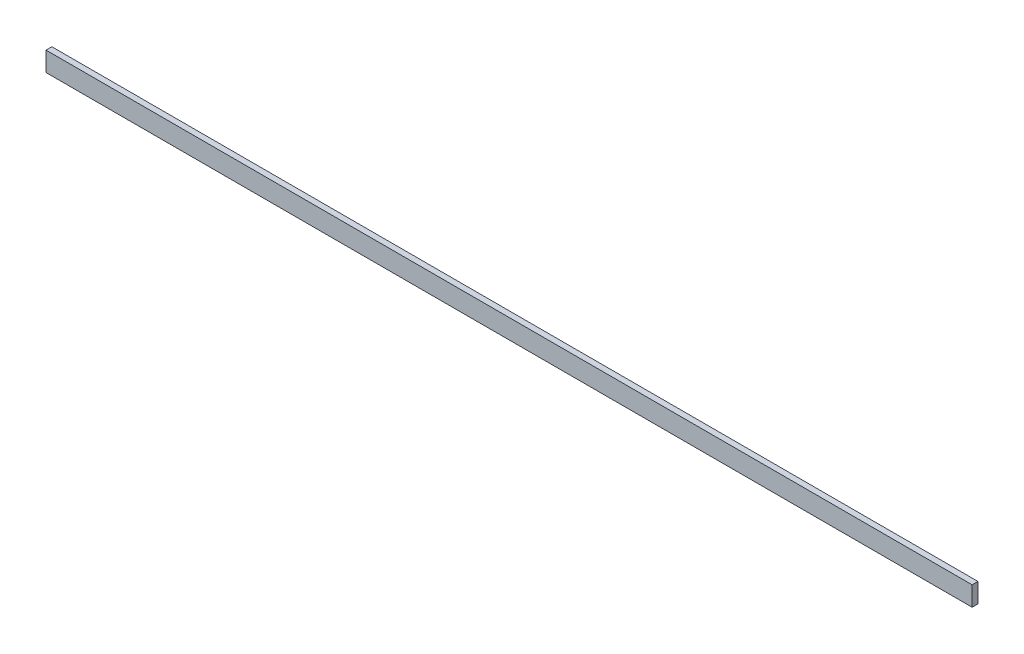
ISO-10303-21;
HEADER;
FILE_DESCRIPTION(('STEP AP214'),'2;1');
FILE_NAME('part.step','',(''),(''),'','','');
FILE_SCHEMA(('AUTOMOTIVE_DESIGN { 1 0 10303 214 1 1 1 1 }'));
ENDSEC;
DATA;
#1=APPLICATION_CONTEXT('core data for automotive mechanical design processes');
#2=APPLICATION_PROTOCOL_DEFINITION('international standard','automotive_design',2000,#1);
#3=PRODUCT_CONTEXT('',#1,'mechanical');
#4=PRODUCT('Part','Part','',(#3));
#5=PRODUCT_RELATED_PRODUCT_CATEGORY('part','',(#4));
#6=PRODUCT_DEFINITION_FORMATION('','',#4);
#7=PRODUCT_DEFINITION_CONTEXT('part definition',#1,'design');
#8=PRODUCT_DEFINITION('design','',#6,#7);
#9=PRODUCT_DEFINITION_SHAPE('','',#8);
#10=(LENGTH_UNIT() NAMED_UNIT(*) SI_UNIT(.MILLI.,.METRE.));
#11=(NAMED_UNIT(*) PLANE_ANGLE_UNIT() SI_UNIT($,.RADIAN.));
#12=(NAMED_UNIT(*) SI_UNIT($,.STERADIAN.) SOLID_ANGLE_UNIT());
#13=UNCERTAINTY_MEASURE_WITH_UNIT(LENGTH_MEASURE(1.E-05),#10,'distance_accuracy_value','');
#14=(GEOMETRIC_REPRESENTATION_CONTEXT(3) GLOBAL_UNCERTAINTY_ASSIGNED_CONTEXT((#13)) GLOBAL_UNIT_ASSIGNED_CONTEXT((#10,
#11,#12)) REPRESENTATION_CONTEXT('',''));
#15=CARTESIAN_POINT('',(0.,0.,0.));
#16=DIRECTION('',(0.,0.,1.));
#17=DIRECTION('',(1.,0.,0.));
#18=AXIS2_PLACEMENT_3D('',#15,#16,#17);
#19=CARTESIAN_POINT('',(0.,0.,-15.));
#20=DIRECTION('',(-1.,0.,0.));
#21=DIRECTION('',(0.,0.,1.));
#22=AXIS2_PLACEMENT_3D('',#19,#20,#21);
#23=PLANE('',#22);
#24=DIRECTION('',(0.,-1.,0.));
#25=VECTOR('',#24,1.);
#26=CARTESIAN_POINT('',(0.,0.,0.));
#27=LINE('',#26,#25);
#28=CARTESIAN_POINT('',(0.,0.,0.));
#29=VERTEX_POINT('',#28);
#30=CARTESIAN_POINT('',(0.,-50.,0.));
#31=VERTEX_POINT('',#30);
#32=EDGE_CURVE('E102',#29,#31,#27,.T.);
#33=ORIENTED_EDGE('',*,*,#32,.F.);
#34=DIRECTION('',(0.,0.,1.));
#35=VECTOR('',#34,1.);
#36=CARTESIAN_POINT('',(0.,0.,-15.));
#37=LINE('',#36,#35);
#38=CARTESIAN_POINT('',(0.,0.,-15.));
#39=VERTEX_POINT('',#38);
#40=EDGE_CURVE('E11',#39,#29,#37,.T.);
#41=ORIENTED_EDGE('',*,*,#40,.F.);
#42=DIRECTION('',(0.,-1.,0.));
#43=VECTOR('',#42,1.);
#44=CARTESIAN_POINT('',(0.,0.,-15.));
#45=LINE('',#44,#43);
#46=CARTESIAN_POINT('',(0.,-50.,-15.));
#47=VERTEX_POINT('',#46);
#48=EDGE_CURVE('E96',#39,#47,#45,.T.);
#49=ORIENTED_EDGE('',*,*,#48,.T.);
#50=DIRECTION('',(0.,0.,1.));
#51=VECTOR('',#50,1.);
#52=CARTESIAN_POINT('',(0.,-50.,-15.));
#53=LINE('',#52,#51);
#54=EDGE_CURVE('E41',#47,#31,#53,.T.);
#55=ORIENTED_EDGE('',*,*,#54,.T.);
#56=EDGE_LOOP('',(#33,#41,#49,#55));
#57=FACE_BOUND('',#56,.T.);
#58=ADVANCED_FACE('F38',(#57),#23,.T.);
#59=CARTESIAN_POINT('',(0.,0.,-15.));
#60=DIRECTION('',(0.,1.,0.));
#61=DIRECTION('',(0.,0.,1.));
#62=AXIS2_PLACEMENT_3D('',#59,#60,#61);
#63=PLANE('',#62);
#64=DIRECTION('',(-1.,0.,0.));
#65=VECTOR('',#64,1.);
#66=CARTESIAN_POINT('',(0.,0.,0.));
#67=LINE('',#66,#65);
#68=CARTESIAN_POINT('',(2380.,0.,0.));
#69=VERTEX_POINT('',#68);
#70=EDGE_CURVE('E98',#69,#29,#67,.T.);
#71=ORIENTED_EDGE('',*,*,#70,.F.);
#72=DIRECTION('',(0.,0.,1.));
#73=VECTOR('',#72,1.);
#74=CARTESIAN_POINT('',(2380.,0.,-15.));
#75=LINE('',#74,#73);
#76=CARTESIAN_POINT('',(2380.,0.,-15.));
#77=VERTEX_POINT('',#76);
#78=EDGE_CURVE('E47',#77,#69,#75,.T.);
#79=ORIENTED_EDGE('',*,*,#78,.F.);
#80=DIRECTION('',(-1.,0.,0.));
#81=VECTOR('',#80,1.);
#82=CARTESIAN_POINT('',(0.,0.,-15.));
#83=LINE('',#82,#81);
#84=EDGE_CURVE('E93',#77,#39,#83,.T.);
#85=ORIENTED_EDGE('',*,*,#84,.T.);
#86=ORIENTED_EDGE('',*,*,#40,.T.);
#87=EDGE_LOOP('',(#71,#79,#85,#86));
#88=FACE_BOUND('',#87,.T.);
#89=ADVANCED_FACE('F112',(#88),#63,.T.);
#90=CARTESIAN_POINT('',(2380.,0.,-15.));
#91=DIRECTION('',(1.,0.,0.));
#92=DIRECTION('',(0.,0.,-1.));
#93=AXIS2_PLACEMENT_3D('',#90,#91,#92);
#94=PLANE('',#93);
#95=DIRECTION('',(0.,1.,0.));
#96=VECTOR('',#95,1.);
#97=CARTESIAN_POINT('',(2380.,0.,0.));
#98=LINE('',#97,#96);
#99=CARTESIAN_POINT('',(2380.,-50.,0.));
#100=VERTEX_POINT('',#99);
#101=EDGE_CURVE('E88',#100,#69,#98,.T.);
#102=ORIENTED_EDGE('',*,*,#101,.F.);
#103=DIRECTION('',(0.,0.,1.));
#104=VECTOR('',#103,1.);
#105=CARTESIAN_POINT('',(2380.,-50.,-15.));
#106=LINE('',#105,#104);
#107=CARTESIAN_POINT('',(2380.,-50.,-15.));
#108=VERTEX_POINT('',#107);
#109=EDGE_CURVE('E83',#108,#100,#106,.T.);
#110=ORIENTED_EDGE('',*,*,#109,.F.);
#111=DIRECTION('',(0.,1.,0.));
#112=VECTOR('',#111,1.);
#113=CARTESIAN_POINT('',(2380.,0.,-15.));
#114=LINE('',#113,#112);
#115=EDGE_CURVE('E86',#108,#77,#114,.T.);
#116=ORIENTED_EDGE('',*,*,#115,.T.);
#117=ORIENTED_EDGE('',*,*,#78,.T.);
#118=EDGE_LOOP('',(#102,#110,#116,#117));
#119=FACE_BOUND('',#118,.T.);
#120=ADVANCED_FACE('F85',(#119),#94,.T.);
#121=CARTESIAN_POINT('',(0.,-50.,-15.));
#122=DIRECTION('',(0.,-1.,0.));
#123=DIRECTION('',(0.,0.,-1.));
#124=AXIS2_PLACEMENT_3D('',#121,#122,#123);
#125=PLANE('',#124);
#126=DIRECTION('',(1.,0.,0.));
#127=VECTOR('',#126,1.);
#128=CARTESIAN_POINT('',(0.,-50.,0.));
#129=LINE('',#128,#127);
#130=EDGE_CURVE('E105',#31,#100,#129,.T.);
#131=ORIENTED_EDGE('',*,*,#130,.F.);
#132=ORIENTED_EDGE('',*,*,#54,.F.);
#133=DIRECTION('',(1.,0.,0.));
#134=VECTOR('',#133,1.);
#135=CARTESIAN_POINT('',(0.,-50.,-15.));
#136=LINE('',#135,#134);
#137=EDGE_CURVE('E92',#47,#108,#136,.T.);
#138=ORIENTED_EDGE('',*,*,#137,.T.);
#139=ORIENTED_EDGE('',*,*,#109,.T.);
#140=EDGE_LOOP('',(#131,#132,#138,#139));
#141=FACE_BOUND('',#140,.T.);
#142=ADVANCED_FACE('F95',(#141),#125,.T.);
#143=CARTESIAN_POINT('',(0.,0.,-15.));
#144=DIRECTION('',(0.,0.,1.));
#145=DIRECTION('',(1.,0.,0.));
#146=AXIS2_PLACEMENT_3D('',#143,#144,#145);
#147=PLANE('',#146);
#148=ORIENTED_EDGE('',*,*,#48,.F.);
#149=ORIENTED_EDGE('',*,*,#84,.F.);
#150=ORIENTED_EDGE('',*,*,#115,.F.);
#151=ORIENTED_EDGE('',*,*,#137,.F.);
#152=EDGE_LOOP('',(#148,#149,#150,#151));
#153=FACE_BOUND('',#152,.T.);
#154=ADVANCED_FACE('F91',(#153),#147,.F.);
#155=CARTESIAN_POINT('',(0.,0.,0.));
#156=DIRECTION('',(0.,0.,1.));
#157=DIRECTION('',(1.,0.,0.));
#158=AXIS2_PLACEMENT_3D('',#155,#156,#157);
#159=PLANE('',#158);
#160=ORIENTED_EDGE('',*,*,#32,.T.);
#161=ORIENTED_EDGE('',*,*,#130,.T.);
#162=ORIENTED_EDGE('',*,*,#101,.T.);
#163=ORIENTED_EDGE('',*,*,#70,.T.);
#164=EDGE_LOOP('',(#160,#161,#162,#163));
#165=FACE_BOUND('',#164,.T.);
#166=ADVANCED_FACE('F111',(#165),#159,.T.);
#167=CLOSED_SHELL('',(#58,#89,#120,#142,#154,#166));
#168=MANIFOLD_SOLID_BREP('B2',#167);
#169=ADVANCED_BREP_SHAPE_REPRESENTATION('',(#18,#168),#14);
#170=SHAPE_DEFINITION_REPRESENTATION(#9,#169);
ENDSEC;
END-ISO-10303-21;
